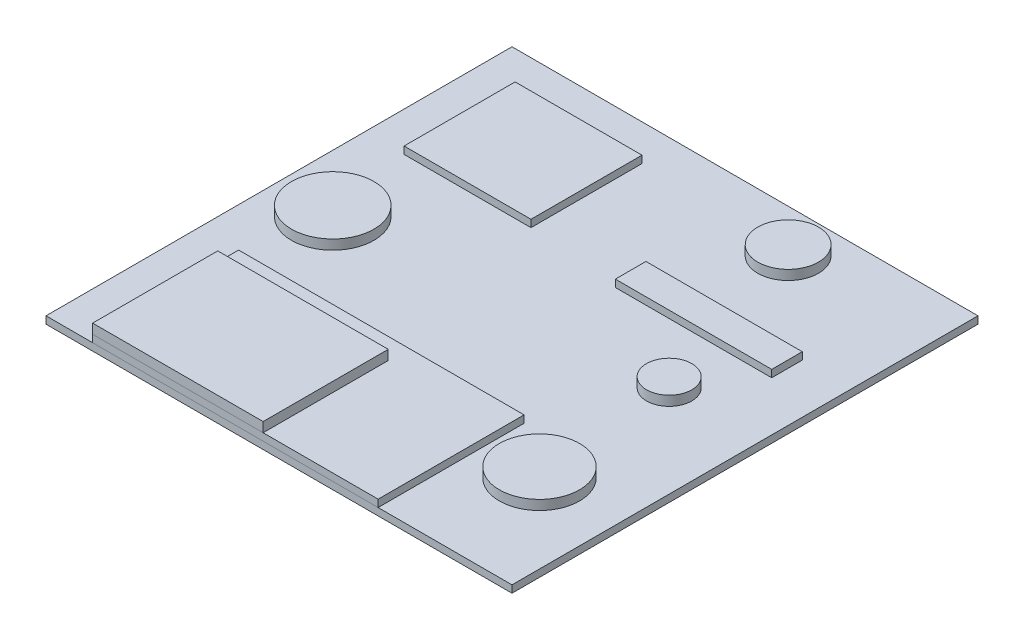
ISO-10303-21;
HEADER;
FILE_DESCRIPTION(('STEP AP214'),'2;1');
FILE_NAME('part.step','',(''),(''),'','','');
FILE_SCHEMA(('AUTOMOTIVE_DESIGN { 1 0 10303 214 1 1 1 1 }'));
ENDSEC;
DATA;
#1=APPLICATION_CONTEXT('core data for automotive mechanical design processes');
#2=APPLICATION_PROTOCOL_DEFINITION('international standard','automotive_design',2000,#1);
#3=PRODUCT_CONTEXT('',#1,'mechanical');
#4=PRODUCT('Part','Part','',(#3));
#5=PRODUCT_RELATED_PRODUCT_CATEGORY('part','',(#4));
#6=PRODUCT_DEFINITION_FORMATION('','',#4);
#7=PRODUCT_DEFINITION_CONTEXT('part definition',#1,'design');
#8=PRODUCT_DEFINITION('design','',#6,#7);
#9=PRODUCT_DEFINITION_SHAPE('','',#8);
#10=(LENGTH_UNIT() NAMED_UNIT(*) SI_UNIT(.MILLI.,.METRE.));
#11=(NAMED_UNIT(*) PLANE_ANGLE_UNIT() SI_UNIT($,.RADIAN.));
#12=(NAMED_UNIT(*) SI_UNIT($,.STERADIAN.) SOLID_ANGLE_UNIT());
#13=UNCERTAINTY_MEASURE_WITH_UNIT(LENGTH_MEASURE(1.E-05),#10,'distance_accuracy_value','');
#14=(GEOMETRIC_REPRESENTATION_CONTEXT(3) GLOBAL_UNCERTAINTY_ASSIGNED_CONTEXT((#13)) GLOBAL_UNIT_ASSIGNED_CONTEXT((#10,
#11,#12)) REPRESENTATION_CONTEXT('',''));
#15=CARTESIAN_POINT('',(0.,0.,0.));
#16=DIRECTION('',(0.,0.,1.));
#17=DIRECTION('',(1.,0.,0.));
#18=AXIS2_PLACEMENT_3D('',#15,#16,#17);
#19=CARTESIAN_POINT('',(403.079177233023,44.45,331.2066033514));
#20=DIRECTION('',(0.,-1.,0.));
#21=DIRECTION('',(0.,0.,-1.));
#22=AXIS2_PLACEMENT_3D('',#19,#20,#21);
#23=CYLINDRICAL_SURFACE('',#22,104.975218642877);
#24=CARTESIAN_POINT('',(403.079177233023,44.45,331.2066033514));
#25=DIRECTION('',(0.,1.,0.));
#26=DIRECTION('',(0.,0.,1.));
#27=AXIS2_PLACEMENT_3D('',#24,#25,#26);
#28=CIRCLE('',#27,104.975218642877);
#29=CARTESIAN_POINT('',(403.079177233023,44.45,436.181821994277));
#30=VERTEX_POINT('',#29);
#31=EDGE_CURVE('E11',#30,#30,#28,.T.);
#32=ORIENTED_EDGE('',*,*,#31,.F.);
#33=EDGE_LOOP('',(#32));
#34=FACE_BOUND('',#33,.T.);
#35=CARTESIAN_POINT('',(403.079177233023,19.05,331.2066033514));
#36=DIRECTION('',(0.,1.,0.));
#37=DIRECTION('',(0.,0.,1.));
#38=AXIS2_PLACEMENT_3D('',#35,#36,#37);
#39=CIRCLE('',#38,104.975218642877);
#40=CARTESIAN_POINT('',(403.079177233023,19.05,436.181821994277));
#41=VERTEX_POINT('',#40);
#42=EDGE_CURVE('E45',#41,#41,#39,.T.);
#43=ORIENTED_EDGE('',*,*,#42,.T.);
#44=EDGE_LOOP('',(#43));
#45=FACE_BOUND('',#44,.T.);
#46=ADVANCED_FACE('F42',(#34,#45),#23,.T.);
#47=CARTESIAN_POINT('',(403.079177233023,44.45,331.2066033514));
#48=DIRECTION('',(0.,1.,0.));
#49=DIRECTION('',(0.,0.,1.));
#50=AXIS2_PLACEMENT_3D('',#47,#48,#49);
#51=PLANE('',#50);
#52=ORIENTED_EDGE('',*,*,#31,.T.);
#53=EDGE_LOOP('',(#52));
#54=FACE_BOUND('',#53,.T.);
#55=ADVANCED_FACE('F57',(#54),#51,.T.);
#56=CARTESIAN_POINT('',(403.079177233023,19.05,331.2066033514));
#57=DIRECTION('',(0.,1.,0.));
#58=DIRECTION('',(0.,0.,1.));
#59=AXIS2_PLACEMENT_3D('',#56,#57,#58);
#60=PLANE('',#59);
#61=ORIENTED_EDGE('',*,*,#42,.F.);
#62=EDGE_LOOP('',(#61));
#63=FACE_BOUND('',#62,.T.);
#64=ADVANCED_FACE('F55',(#63),#60,.F.);
#65=CLOSED_SHELL('',(#46,#55,#64));
#66=MANIFOLD_SOLID_BREP('B2',#65);
#67=CARTESIAN_POINT('',(225.250128453748,44.45,-497.180382212056));
#68=DIRECTION('',(0.,-1.,0.));
#69=DIRECTION('',(0.,0.,-1.));
#70=AXIS2_PLACEMENT_3D('',#67,#68,#69);
#71=CYLINDRICAL_SURFACE('',#70,79.4308614038405);
#72=CARTESIAN_POINT('',(225.250128453748,44.45,-497.180382212056));
#73=DIRECTION('',(0.,1.,0.));
#74=DIRECTION('',(0.,0.,1.));
#75=AXIS2_PLACEMENT_3D('',#72,#73,#74);
#76=CIRCLE('',#75,79.4308614038405);
#77=CARTESIAN_POINT('',(225.250128453748,44.45,-417.749520808216));
#78=VERTEX_POINT('',#77);
#79=EDGE_CURVE('E41',#78,#78,#76,.T.);
#80=ORIENTED_EDGE('',*,*,#79,.F.);
#81=EDGE_LOOP('',(#80));
#82=FACE_BOUND('',#81,.T.);
#83=CARTESIAN_POINT('',(225.250128453748,19.05,-497.180382212056));
#84=DIRECTION('',(0.,1.,0.));
#85=DIRECTION('',(0.,0.,1.));
#86=AXIS2_PLACEMENT_3D('',#83,#84,#85);
#87=CIRCLE('',#86,79.4308614038405);
#88=CARTESIAN_POINT('',(225.250128453748,19.05,-417.749520808216));
#89=VERTEX_POINT('',#88);
#90=EDGE_CURVE('E96',#89,#89,#87,.T.);
#91=ORIENTED_EDGE('',*,*,#90,.T.);
#92=EDGE_LOOP('',(#91));
#93=FACE_BOUND('',#92,.T.);
#94=ADVANCED_FACE('F93',(#82,#93),#71,.T.);
#95=CARTESIAN_POINT('',(225.250128453748,44.45,-497.180382212056));
#96=DIRECTION('',(0.,1.,0.));
#97=DIRECTION('',(0.,0.,1.));
#98=AXIS2_PLACEMENT_3D('',#95,#96,#97);
#99=PLANE('',#98);
#100=ORIENTED_EDGE('',*,*,#79,.T.);
#101=EDGE_LOOP('',(#100));
#102=FACE_BOUND('',#101,.T.);
#103=ADVANCED_FACE('F108',(#102),#99,.T.);
#104=CARTESIAN_POINT('',(225.250128453748,19.05,-497.180382212056));
#105=DIRECTION('',(0.,1.,0.));
#106=DIRECTION('',(0.,0.,1.));
#107=AXIS2_PLACEMENT_3D('',#104,#105,#106);
#108=PLANE('',#107);
#109=ORIENTED_EDGE('',*,*,#90,.F.);
#110=EDGE_LOOP('',(#109));
#111=FACE_BOUND('',#110,.T.);
#112=ADVANCED_FACE('F106',(#111),#108,.F.);
#113=CLOSED_SHELL('',(#94,#103,#112));
#114=MANIFOLD_SOLID_BREP('B6',#113);
#115=CARTESIAN_POINT('',(368.995276216995,44.45,-42.2343990850776));
#116=DIRECTION('',(0.,-1.,0.));
#117=DIRECTION('',(0.,0.,-1.));
#118=AXIS2_PLACEMENT_3D('',#115,#116,#117);
#119=CYLINDRICAL_SURFACE('',#118,59.2763495930917);
#120=CARTESIAN_POINT('',(368.995276216995,44.45,-42.2343990850776));
#121=DIRECTION('',(0.,1.,0.));
#122=DIRECTION('',(0.,0.,1.));
#123=AXIS2_PLACEMENT_3D('',#120,#121,#122);
#124=CIRCLE('',#123,59.2763495930917);
#125=CARTESIAN_POINT('',(368.995276216995,44.45,17.0419505080142));
#126=VERTEX_POINT('',#125);
#127=EDGE_CURVE('E92',#126,#126,#124,.T.);
#128=ORIENTED_EDGE('',*,*,#127,.F.);
#129=EDGE_LOOP('',(#128));
#130=FACE_BOUND('',#129,.T.);
#131=CARTESIAN_POINT('',(368.995276216995,19.05,-42.2343990850776));
#132=DIRECTION('',(0.,1.,0.));
#133=DIRECTION('',(0.,0.,1.));
#134=AXIS2_PLACEMENT_3D('',#131,#132,#133);
#135=CIRCLE('',#134,59.2763495930917);
#136=CARTESIAN_POINT('',(368.995276216995,19.05,17.0419505080142));
#137=VERTEX_POINT('',#136);
#138=EDGE_CURVE('E147',#137,#137,#135,.T.);
#139=ORIENTED_EDGE('',*,*,#138,.T.);
#140=EDGE_LOOP('',(#139));
#141=FACE_BOUND('',#140,.T.);
#142=ADVANCED_FACE('F144',(#130,#141),#119,.T.);
#143=CARTESIAN_POINT('',(368.995276216995,44.45,-42.2343990850776));
#144=DIRECTION('',(0.,1.,0.));
#145=DIRECTION('',(0.,0.,1.));
#146=AXIS2_PLACEMENT_3D('',#143,#144,#145);
#147=PLANE('',#146);
#148=ORIENTED_EDGE('',*,*,#127,.T.);
#149=EDGE_LOOP('',(#148));
#150=FACE_BOUND('',#149,.T.);
#151=ADVANCED_FACE('F159',(#150),#147,.T.);
#152=CARTESIAN_POINT('',(368.995276216995,19.05,-42.2343990850776));
#153=DIRECTION('',(0.,1.,0.));
#154=DIRECTION('',(0.,0.,1.));
#155=AXIS2_PLACEMENT_3D('',#152,#153,#154);
#156=PLANE('',#155);
#157=ORIENTED_EDGE('',*,*,#138,.F.);
#158=EDGE_LOOP('',(#157));
#159=FACE_BOUND('',#158,.T.);
#160=ADVANCED_FACE('F157',(#159),#156,.F.);
#161=CLOSED_SHELL('',(#142,#151,#160));
#162=MANIFOLD_SOLID_BREP('B36',#161);
#163=CARTESIAN_POINT('',(-459.391709346461,44.45,9.63240680887765));
#164=DIRECTION('',(0.,-1.,0.));
#165=DIRECTION('',(0.,0.,-1.));
#166=AXIS2_PLACEMENT_3D('',#163,#164,#165);
#167=CYLINDRICAL_SURFACE('',#166,107.935461676881);
#168=CARTESIAN_POINT('',(-459.391709346461,44.45,9.63240680887765));
#169=DIRECTION('',(0.,1.,0.));
#170=DIRECTION('',(0.,0.,1.));
#171=AXIS2_PLACEMENT_3D('',#168,#169,#170);
#172=CIRCLE('',#171,107.935461676881);
#173=CARTESIAN_POINT('',(-459.391709346461,44.45,117.567868485758));
#174=VERTEX_POINT('',#173);
#175=EDGE_CURVE('E143',#174,#174,#172,.T.);
#176=ORIENTED_EDGE('',*,*,#175,.F.);
#177=EDGE_LOOP('',(#176));
#178=FACE_BOUND('',#177,.T.);
#179=CARTESIAN_POINT('',(-459.391709346461,19.05,9.63240680887765));
#180=DIRECTION('',(0.,1.,0.));
#181=DIRECTION('',(0.,0.,1.));
#182=AXIS2_PLACEMENT_3D('',#179,#180,#181);
#183=CIRCLE('',#182,107.935461676881);
#184=CARTESIAN_POINT('',(-459.391709346461,19.05,117.567868485758));
#185=VERTEX_POINT('',#184);
#186=EDGE_CURVE('E200',#185,#185,#183,.T.);
#187=ORIENTED_EDGE('',*,*,#186,.T.);
#188=EDGE_LOOP('',(#187));
#189=FACE_BOUND('',#188,.T.);
#190=ADVANCED_FACE('F197',(#178,#189),#167,.T.);
#191=CARTESIAN_POINT('',(-459.391709346461,44.45,9.63240680887765));
#192=DIRECTION('',(0.,1.,0.));
#193=DIRECTION('',(0.,0.,1.));
#194=AXIS2_PLACEMENT_3D('',#191,#192,#193);
#195=PLANE('',#194);
#196=ORIENTED_EDGE('',*,*,#175,.T.);
#197=EDGE_LOOP('',(#196));
#198=FACE_BOUND('',#197,.T.);
#199=ADVANCED_FACE('F212',(#198),#195,.T.);
#200=CARTESIAN_POINT('',(-459.391709346461,19.05,9.63240680887765));
#201=DIRECTION('',(0.,1.,0.));
#202=DIRECTION('',(0.,0.,1.));
#203=AXIS2_PLACEMENT_3D('',#200,#201,#202);
#204=PLANE('',#203);
#205=ORIENTED_EDGE('',*,*,#186,.F.);
#206=EDGE_LOOP('',(#205));
#207=FACE_BOUND('',#206,.T.);
#208=ADVANCED_FACE('F210',(#207),#204,.F.);
#209=CLOSED_SHELL('',(#190,#199,#208));
#210=MANIFOLD_SOLID_BREP('B87',#209);
#211=CARTESIAN_POINT('',(-487.547975403179,63.5,282.303614937099));
#212=DIRECTION('',(1.,0.,0.));
#213=DIRECTION('',(0.,0.,-1.));
#214=AXIS2_PLACEMENT_3D('',#211,#212,#213);
#215=PLANE('',#214);
#216=DIRECTION('',(0.,0.,1.));
#217=VECTOR('',#216,1.);
#218=CARTESIAN_POINT('',(-487.547975403179,38.1,282.303614937099));
#219=LINE('',#218,#217);
#220=CARTESIAN_POINT('',(-487.547975403179,38.1,282.303614937099));
#221=VERTEX_POINT('',#220);
#222=CARTESIAN_POINT('',(-487.547975403179,38.1,609.6));
#223=VERTEX_POINT('',#222);
#224=EDGE_CURVE('E312',#221,#223,#219,.T.);
#225=ORIENTED_EDGE('',*,*,#224,.T.);
#226=DIRECTION('',(0.,-1.,0.));
#227=VECTOR('',#226,1.);
#228=CARTESIAN_POINT('',(-487.547975403179,63.5,609.6));
#229=LINE('',#228,#227);
#230=CARTESIAN_POINT('',(-487.547975403179,63.5,609.6));
#231=VERTEX_POINT('',#230);
#232=EDGE_CURVE('E195',#231,#223,#229,.T.);
#233=ORIENTED_EDGE('',*,*,#232,.F.);
#234=DIRECTION('',(0.,0.,1.));
#235=VECTOR('',#234,1.);
#236=CARTESIAN_POINT('',(-487.547975403179,63.5,282.303614937099));
#237=LINE('',#236,#235);
#238=CARTESIAN_POINT('',(-487.547975403179,63.5,282.303614937099));
#239=VERTEX_POINT('',#238);
#240=EDGE_CURVE('E300',#239,#231,#237,.T.);
#241=ORIENTED_EDGE('',*,*,#240,.F.);
#242=DIRECTION('',(0.,-1.,0.));
#243=VECTOR('',#242,1.);
#244=CARTESIAN_POINT('',(-487.547975403179,63.5,282.303614937099));
#245=LINE('',#244,#243);
#246=EDGE_CURVE('E308',#239,#221,#245,.T.);
#247=ORIENTED_EDGE('',*,*,#246,.T.);
#248=EDGE_LOOP('',(#225,#233,#241,#247));
#249=FACE_BOUND('',#248,.T.);
#250=ADVANCED_FACE('F249',(#249),#215,.F.);
#251=CARTESIAN_POINT('',(-487.547975403179,63.5,609.6));
#252=DIRECTION('',(0.,0.,-1.));
#253=DIRECTION('',(-1.,0.,0.));
#254=AXIS2_PLACEMENT_3D('',#251,#252,#253);
#255=PLANE('',#254);
#256=DIRECTION('',(1.,0.,0.));
#257=VECTOR('',#256,1.);
#258=CARTESIAN_POINT('',(-487.547975403179,38.1,609.6));
#259=LINE('',#258,#257);
#260=CARTESIAN_POINT('',(-41.4934447151643,38.1,609.6));
#261=VERTEX_POINT('',#260);
#262=EDGE_CURVE('E304',#223,#261,#259,.T.);
#263=ORIENTED_EDGE('',*,*,#262,.T.);
#264=DIRECTION('',(0.,-1.,0.));
#265=VECTOR('',#264,1.);
#266=CARTESIAN_POINT('',(-41.4934447151643,63.5,609.6));
#267=LINE('',#266,#265);
#268=CARTESIAN_POINT('',(-41.4934447151643,63.5,609.6));
#269=VERTEX_POINT('',#268);
#270=EDGE_CURVE('E257',#269,#261,#267,.T.);
#271=ORIENTED_EDGE('',*,*,#270,.F.);
#272=DIRECTION('',(1.,0.,0.));
#273=VECTOR('',#272,1.);
#274=CARTESIAN_POINT('',(-487.547975403179,63.5,609.6));
#275=LINE('',#274,#273);
#276=EDGE_CURVE('E295',#231,#269,#275,.T.);
#277=ORIENTED_EDGE('',*,*,#276,.F.);
#278=ORIENTED_EDGE('',*,*,#232,.T.);
#279=EDGE_LOOP('',(#263,#271,#277,#278));
#280=FACE_BOUND('',#279,.T.);
#281=ADVANCED_FACE('F303',(#280),#255,.F.);
#282=CARTESIAN_POINT('',(-41.4934447151643,63.5,282.303614937099));
#283=DIRECTION('',(-1.,0.,0.));
#284=DIRECTION('',(0.,0.,1.));
#285=AXIS2_PLACEMENT_3D('',#282,#283,#284);
#286=PLANE('',#285);
#287=DIRECTION('',(0.,0.,-1.));
#288=VECTOR('',#287,1.);
#289=CARTESIAN_POINT('',(-41.4934447151643,38.1,282.303614937099));
#290=LINE('',#289,#288);
#291=CARTESIAN_POINT('',(-41.4934447151643,38.1,282.303614937099));
#292=VERTEX_POINT('',#291);
#293=EDGE_CURVE('E282',#261,#292,#290,.T.);
#294=ORIENTED_EDGE('',*,*,#293,.T.);
#295=DIRECTION('',(0.,-1.,0.));
#296=VECTOR('',#295,1.);
#297=CARTESIAN_POINT('',(-41.4934447151643,63.5,282.303614937099));
#298=LINE('',#297,#296);
#299=CARTESIAN_POINT('',(-41.4934447151643,63.5,282.303614937099));
#300=VERTEX_POINT('',#299);
#301=EDGE_CURVE('E305',#300,#292,#298,.T.);
#302=ORIENTED_EDGE('',*,*,#301,.F.);
#303=DIRECTION('',(0.,0.,-1.));
#304=VECTOR('',#303,1.);
#305=CARTESIAN_POINT('',(-41.4934447151643,63.5,282.303614937099));
#306=LINE('',#305,#304);
#307=EDGE_CURVE('E298',#269,#300,#306,.T.);
#308=ORIENTED_EDGE('',*,*,#307,.F.);
#309=ORIENTED_EDGE('',*,*,#270,.T.);
#310=EDGE_LOOP('',(#294,#302,#308,#309));
#311=FACE_BOUND('',#310,.T.);
#312=ADVANCED_FACE('F306',(#311),#286,.F.);
#313=CARTESIAN_POINT('',(-487.547975403179,63.5,282.303614937099));
#314=DIRECTION('',(0.,0.,1.));
#315=DIRECTION('',(1.,0.,0.));
#316=AXIS2_PLACEMENT_3D('',#313,#314,#315);
#317=PLANE('',#316);
#318=DIRECTION('',(-1.,0.,0.));
#319=VECTOR('',#318,1.);
#320=CARTESIAN_POINT('',(-487.547975403179,38.1,282.303614937099));
#321=LINE('',#320,#319);
#322=EDGE_CURVE('E288',#292,#221,#321,.T.);
#323=ORIENTED_EDGE('',*,*,#322,.T.);
#324=ORIENTED_EDGE('',*,*,#246,.F.);
#325=DIRECTION('',(-1.,0.,0.));
#326=VECTOR('',#325,1.);
#327=CARTESIAN_POINT('',(-487.547975403179,63.5,282.303614937099));
#328=LINE('',#327,#326);
#329=EDGE_CURVE('E265',#300,#239,#328,.T.);
#330=ORIENTED_EDGE('',*,*,#329,.F.);
#331=ORIENTED_EDGE('',*,*,#301,.T.);
#332=EDGE_LOOP('',(#323,#324,#330,#331));
#333=FACE_BOUND('',#332,.T.);
#334=ADVANCED_FACE('F319',(#333),#317,.F.);
#335=CARTESIAN_POINT('',(-487.547975403179,63.5,609.6));
#336=DIRECTION('',(0.,1.,0.));
#337=DIRECTION('',(0.,0.,1.));
#338=AXIS2_PLACEMENT_3D('',#335,#336,#337);
#339=PLANE('',#338);
#340=ORIENTED_EDGE('',*,*,#240,.T.);
#341=ORIENTED_EDGE('',*,*,#276,.T.);
#342=ORIENTED_EDGE('',*,*,#307,.T.);
#343=ORIENTED_EDGE('',*,*,#329,.T.);
#344=EDGE_LOOP('',(#340,#341,#342,#343));
#345=FACE_BOUND('',#344,.T.);
#346=ADVANCED_FACE('F296',(#345),#339,.T.);
#347=CARTESIAN_POINT('',(-487.547975403179,38.1,609.6));
#348=DIRECTION('',(0.,1.,0.));
#349=DIRECTION('',(0.,0.,1.));
#350=AXIS2_PLACEMENT_3D('',#347,#348,#349);
#351=PLANE('',#350);
#352=ORIENTED_EDGE('',*,*,#224,.F.);
#353=ORIENTED_EDGE('',*,*,#322,.F.);
#354=ORIENTED_EDGE('',*,*,#293,.F.);
#355=ORIENTED_EDGE('',*,*,#262,.F.);
#356=EDGE_LOOP('',(#352,#353,#354,#355));
#357=FACE_BOUND('',#356,.T.);
#358=ADVANCED_FACE('F322',(#357),#351,.F.);
#359=CLOSED_SHELL('',(#250,#281,#312,#334,#346,#358));
#360=MANIFOLD_SOLID_BREP('B138',#359);
#361=CARTESIAN_POINT('',(259.334029469776,38.1,227.67843800242));
#362=DIRECTION('',(-1.,0.,0.));
#363=DIRECTION('',(0.,0.,1.));
#364=AXIS2_PLACEMENT_3D('',#361,#362,#363);
#365=PLANE('',#364);
#366=DIRECTION('',(0.,0.,-1.));
#367=VECTOR('',#366,1.);
#368=CARTESIAN_POINT('',(259.334029469776,19.05,227.67843800242));
#369=LINE('',#368,#367);
#370=CARTESIAN_POINT('',(259.334029469776,19.05,609.6));
#371=VERTEX_POINT('',#370);
#372=CARTESIAN_POINT('',(259.334029469776,19.05,227.67843800242));
#373=VERTEX_POINT('',#372);
#374=EDGE_CURVE('E447',#371,#373,#369,.T.);
#375=ORIENTED_EDGE('',*,*,#374,.T.);
#376=DIRECTION('',(0.,-1.,0.));
#377=VECTOR('',#376,1.);
#378=CARTESIAN_POINT('',(259.334029469776,38.1,227.67843800242));
#379=LINE('',#378,#377);
#380=CARTESIAN_POINT('',(259.334029469776,38.1,227.67843800242));
#381=VERTEX_POINT('',#380);
#382=EDGE_CURVE('E247',#381,#373,#379,.T.);
#383=ORIENTED_EDGE('',*,*,#382,.F.);
#384=DIRECTION('',(0.,0.,-1.));
#385=VECTOR('',#384,1.);
#386=CARTESIAN_POINT('',(259.334029469776,38.1,227.67843800242));
#387=LINE('',#386,#385);
#388=CARTESIAN_POINT('',(259.334029469776,38.1,609.6));
#389=VERTEX_POINT('',#388);
#390=EDGE_CURVE('E435',#389,#381,#387,.T.);
#391=ORIENTED_EDGE('',*,*,#390,.F.);
#392=DIRECTION('',(0.,-1.,0.));
#393=VECTOR('',#392,1.);
#394=CARTESIAN_POINT('',(259.334029469776,38.1,609.6));
#395=LINE('',#394,#393);
#396=EDGE_CURVE('E443',#389,#371,#395,.T.);
#397=ORIENTED_EDGE('',*,*,#396,.T.);
#398=EDGE_LOOP('',(#375,#383,#391,#397));
#399=FACE_BOUND('',#398,.T.);
#400=ADVANCED_FACE('F384',(#399),#365,.F.);
#401=CARTESIAN_POINT('',(-487.547975403179,38.1,227.67843800242));
#402=DIRECTION('',(0.,0.,1.));
#403=DIRECTION('',(1.,0.,0.));
#404=AXIS2_PLACEMENT_3D('',#401,#402,#403);
#405=PLANE('',#404);
#406=DIRECTION('',(-1.,0.,0.));
#407=VECTOR('',#406,1.);
#408=CARTESIAN_POINT('',(-487.547975403179,19.05,227.67843800242));
#409=LINE('',#408,#407);
#410=CARTESIAN_POINT('',(-487.547975403179,19.05,227.67843800242));
#411=VERTEX_POINT('',#410);
#412=EDGE_CURVE('E439',#373,#411,#409,.T.);
#413=ORIENTED_EDGE('',*,*,#412,.T.);
#414=DIRECTION('',(0.,-1.,0.));
#415=VECTOR('',#414,1.);
#416=CARTESIAN_POINT('',(-487.547975403179,38.1,227.67843800242));
#417=LINE('',#416,#415);
#418=CARTESIAN_POINT('',(-487.547975403179,38.1,227.67843800242));
#419=VERTEX_POINT('',#418);
#420=EDGE_CURVE('E392',#419,#411,#417,.T.);
#421=ORIENTED_EDGE('',*,*,#420,.F.);
#422=DIRECTION('',(-1.,0.,0.));
#423=VECTOR('',#422,1.);
#424=CARTESIAN_POINT('',(-487.547975403179,38.1,227.67843800242));
#425=LINE('',#424,#423);
#426=EDGE_CURVE('E430',#381,#419,#425,.T.);
#427=ORIENTED_EDGE('',*,*,#426,.F.);
#428=ORIENTED_EDGE('',*,*,#382,.T.);
#429=EDGE_LOOP('',(#413,#421,#427,#428));
#430=FACE_BOUND('',#429,.T.);
#431=ADVANCED_FACE('F438',(#430),#405,.F.);
#432=CARTESIAN_POINT('',(-487.547975403179,38.1,227.67843800242));
#433=DIRECTION('',(1.,0.,0.));
#434=DIRECTION('',(0.,0.,-1.));
#435=AXIS2_PLACEMENT_3D('',#432,#433,#434);
#436=PLANE('',#435);
#437=DIRECTION('',(0.,0.,1.));
#438=VECTOR('',#437,1.);
#439=CARTESIAN_POINT('',(-487.547975403179,19.05,227.67843800242));
#440=LINE('',#439,#438);
#441=CARTESIAN_POINT('',(-487.547975403179,19.05,609.6));
#442=VERTEX_POINT('',#441);
#443=EDGE_CURVE('E417',#411,#442,#440,.T.);
#444=ORIENTED_EDGE('',*,*,#443,.T.);
#445=DIRECTION('',(0.,-1.,0.));
#446=VECTOR('',#445,1.);
#447=CARTESIAN_POINT('',(-487.547975403179,38.1,609.6));
#448=LINE('',#447,#446);
#449=CARTESIAN_POINT('',(-487.547975403179,38.1,609.6));
#450=VERTEX_POINT('',#449);
#451=EDGE_CURVE('E440',#450,#442,#448,.T.);
#452=ORIENTED_EDGE('',*,*,#451,.F.);
#453=DIRECTION('',(0.,0.,1.));
#454=VECTOR('',#453,1.);
#455=CARTESIAN_POINT('',(-487.547975403179,38.1,227.67843800242));
#456=LINE('',#455,#454);
#457=EDGE_CURVE('E433',#419,#450,#456,.T.);
#458=ORIENTED_EDGE('',*,*,#457,.F.);
#459=ORIENTED_EDGE('',*,*,#420,.T.);
#460=EDGE_LOOP('',(#444,#452,#458,#459));
#461=FACE_BOUND('',#460,.T.);
#462=ADVANCED_FACE('F441',(#461),#436,.F.);
#463=CARTESIAN_POINT('',(-487.547975403179,38.1,609.6));
#464=DIRECTION('',(0.,0.,-1.));
#465=DIRECTION('',(-1.,0.,0.));
#466=AXIS2_PLACEMENT_3D('',#463,#464,#465);
#467=PLANE('',#466);
#468=DIRECTION('',(1.,0.,0.));
#469=VECTOR('',#468,1.);
#470=CARTESIAN_POINT('',(-487.547975403179,19.05,609.6));
#471=LINE('',#470,#469);
#472=EDGE_CURVE('E423',#442,#371,#471,.T.);
#473=ORIENTED_EDGE('',*,*,#472,.T.);
#474=ORIENTED_EDGE('',*,*,#396,.F.);
#475=DIRECTION('',(1.,0.,0.));
#476=VECTOR('',#475,1.);
#477=CARTESIAN_POINT('',(-487.547975403179,38.1,609.6));
#478=LINE('',#477,#476);
#479=EDGE_CURVE('E400',#450,#389,#478,.T.);
#480=ORIENTED_EDGE('',*,*,#479,.F.);
#481=ORIENTED_EDGE('',*,*,#451,.T.);
#482=EDGE_LOOP('',(#473,#474,#480,#481));
#483=FACE_BOUND('',#482,.T.);
#484=ADVANCED_FACE('F454',(#483),#467,.F.);
#485=CARTESIAN_POINT('',(259.334029469776,38.1,609.6));
#486=DIRECTION('',(0.,1.,0.));
#487=DIRECTION('',(0.,0.,1.));
#488=AXIS2_PLACEMENT_3D('',#485,#486,#487);
#489=PLANE('',#488);
#490=ORIENTED_EDGE('',*,*,#390,.T.);
#491=ORIENTED_EDGE('',*,*,#426,.T.);
#492=ORIENTED_EDGE('',*,*,#457,.T.);
#493=ORIENTED_EDGE('',*,*,#479,.T.);
#494=EDGE_LOOP('',(#490,#491,#492,#493));
#495=FACE_BOUND('',#494,.T.);
#496=ADVANCED_FACE('F431',(#495),#489,.T.);
#497=CARTESIAN_POINT('',(259.334029469776,19.05,609.6));
#498=DIRECTION('',(0.,1.,0.));
#499=DIRECTION('',(0.,0.,1.));
#500=AXIS2_PLACEMENT_3D('',#497,#498,#499);
#501=PLANE('',#500);
#502=ORIENTED_EDGE('',*,*,#374,.F.);
#503=ORIENTED_EDGE('',*,*,#472,.F.);
#504=ORIENTED_EDGE('',*,*,#443,.F.);
#505=ORIENTED_EDGE('',*,*,#412,.F.);
#506=EDGE_LOOP('',(#502,#503,#504,#505));
#507=FACE_BOUND('',#506,.T.);
#508=ADVANCED_FACE('F457',(#507),#501,.F.);
#509=CLOSED_SHELL('',(#400,#431,#462,#484,#496,#508));
#510=MANIFOLD_SOLID_BREP('B189',#509);
#511=CARTESIAN_POINT('',(480.138431704042,38.1,-279.339797457444));
#512=DIRECTION('',(-1.,0.,0.));
#513=DIRECTION('',(0.,0.,1.));
#514=AXIS2_PLACEMENT_3D('',#511,#512,#513);
#515=PLANE('',#514);
#516=DIRECTION('',(0.,0.,-1.));
#517=VECTOR('',#516,1.);
#518=CARTESIAN_POINT('',(480.138431704042,19.05,-279.339797457444));
#519=LINE('',#518,#517);
#520=CARTESIAN_POINT('',(480.138431704042,19.05,-199.316725506771));
#521=VERTEX_POINT('',#520);
#522=CARTESIAN_POINT('',(480.138431704042,19.05,-279.339797457444));
#523=VERTEX_POINT('',#522);
#524=EDGE_CURVE('E582',#521,#523,#519,.T.);
#525=ORIENTED_EDGE('',*,*,#524,.T.);
#526=DIRECTION('',(0.,-1.,0.));
#527=VECTOR('',#526,1.);
#528=CARTESIAN_POINT('',(480.138431704042,38.1,-279.339797457444));
#529=LINE('',#528,#527);
#530=CARTESIAN_POINT('',(480.138431704042,38.1,-279.339797457444));
#531=VERTEX_POINT('',#530);
#532=EDGE_CURVE('E382',#531,#523,#529,.T.);
#533=ORIENTED_EDGE('',*,*,#532,.F.);
#534=DIRECTION('',(0.,0.,-1.));
#535=VECTOR('',#534,1.);
#536=CARTESIAN_POINT('',(480.138431704042,38.1,-279.339797457444));
#537=LINE('',#536,#535);
#538=CARTESIAN_POINT('',(480.138431704042,38.1,-199.316725506771));
#539=VERTEX_POINT('',#538);
#540=EDGE_CURVE('E570',#539,#531,#537,.T.);
#541=ORIENTED_EDGE('',*,*,#540,.F.);
#542=DIRECTION('',(0.,-1.,0.));
#543=VECTOR('',#542,1.);
#544=CARTESIAN_POINT('',(480.138431704042,38.1,-199.316725506771));
#545=LINE('',#544,#543);
#546=EDGE_CURVE('E578',#539,#521,#545,.T.);
#547=ORIENTED_EDGE('',*,*,#546,.T.);
#548=EDGE_LOOP('',(#525,#533,#541,#547));
#549=FACE_BOUND('',#548,.T.);
#550=ADVANCED_FACE('F519',(#549),#515,.F.);
#551=CARTESIAN_POINT('',(71.13161951171,38.1,-279.339797457444));
#552=DIRECTION('',(0.,0.,1.));
#553=DIRECTION('',(1.,0.,0.));
#554=AXIS2_PLACEMENT_3D('',#551,#552,#553);
#555=PLANE('',#554);
#556=DIRECTION('',(-1.,0.,0.));
#557=VECTOR('',#556,1.);
#558=CARTESIAN_POINT('',(71.13161951171,19.05,-279.339797457444));
#559=LINE('',#558,#557);
#560=CARTESIAN_POINT('',(71.13161951171,19.05,-279.339797457444));
#561=VERTEX_POINT('',#560);
#562=EDGE_CURVE('E574',#523,#561,#559,.T.);
#563=ORIENTED_EDGE('',*,*,#562,.T.);
#564=DIRECTION('',(0.,-1.,0.));
#565=VECTOR('',#564,1.);
#566=CARTESIAN_POINT('',(71.13161951171,38.1,-279.339797457444));
#567=LINE('',#566,#565);
#568=CARTESIAN_POINT('',(71.13161951171,38.1,-279.339797457444));
#569=VERTEX_POINT('',#568);
#570=EDGE_CURVE('E527',#569,#561,#567,.T.);
#571=ORIENTED_EDGE('',*,*,#570,.F.);
#572=DIRECTION('',(-1.,0.,0.));
#573=VECTOR('',#572,1.);
#574=CARTESIAN_POINT('',(71.13161951171,38.1,-279.339797457444));
#575=LINE('',#574,#573);
#576=EDGE_CURVE('E565',#531,#569,#575,.T.);
#577=ORIENTED_EDGE('',*,*,#576,.F.);
#578=ORIENTED_EDGE('',*,*,#532,.T.);
#579=EDGE_LOOP('',(#563,#571,#577,#578));
#580=FACE_BOUND('',#579,.T.);
#581=ADVANCED_FACE('F573',(#580),#555,.F.);
#582=CARTESIAN_POINT('',(71.13161951171,38.1,-279.339797457444));
#583=DIRECTION('',(1.,0.,0.));
#584=DIRECTION('',(0.,0.,-1.));
#585=AXIS2_PLACEMENT_3D('',#582,#583,#584);
#586=PLANE('',#585);
#587=DIRECTION('',(0.,0.,1.));
#588=VECTOR('',#587,1.);
#589=CARTESIAN_POINT('',(71.13161951171,19.05,-279.339797457444));
#590=LINE('',#589,#588);
#591=CARTESIAN_POINT('',(71.13161951171,19.05,-199.316725506771));
#592=VERTEX_POINT('',#591);
#593=EDGE_CURVE('E552',#561,#592,#590,.T.);
#594=ORIENTED_EDGE('',*,*,#593,.T.);
#595=DIRECTION('',(0.,-1.,0.));
#596=VECTOR('',#595,1.);
#597=CARTESIAN_POINT('',(71.13161951171,38.1,-199.316725506771));
#598=LINE('',#597,#596);
#599=CARTESIAN_POINT('',(71.13161951171,38.1,-199.316725506771));
#600=VERTEX_POINT('',#599);
#601=EDGE_CURVE('E575',#600,#592,#598,.T.);
#602=ORIENTED_EDGE('',*,*,#601,.F.);
#603=DIRECTION('',(0.,0.,1.));
#604=VECTOR('',#603,1.);
#605=CARTESIAN_POINT('',(71.13161951171,38.1,-279.339797457444));
#606=LINE('',#605,#604);
#607=EDGE_CURVE('E568',#569,#600,#606,.T.);
#608=ORIENTED_EDGE('',*,*,#607,.F.);
#609=ORIENTED_EDGE('',*,*,#570,.T.);
#610=EDGE_LOOP('',(#594,#602,#608,#609));
#611=FACE_BOUND('',#610,.T.);
#612=ADVANCED_FACE('F576',(#611),#586,.F.);
#613=CARTESIAN_POINT('',(71.13161951171,38.1,-199.316725506771));
#614=DIRECTION('',(0.,0.,-1.));
#615=DIRECTION('',(-1.,0.,0.));
#616=AXIS2_PLACEMENT_3D('',#613,#614,#615);
#617=PLANE('',#616);
#618=DIRECTION('',(1.,0.,0.));
#619=VECTOR('',#618,1.);
#620=CARTESIAN_POINT('',(71.13161951171,19.05,-199.316725506771));
#621=LINE('',#620,#619);
#622=EDGE_CURVE('E558',#592,#521,#621,.T.);
#623=ORIENTED_EDGE('',*,*,#622,.T.);
#624=ORIENTED_EDGE('',*,*,#546,.F.);
#625=DIRECTION('',(1.,0.,0.));
#626=VECTOR('',#625,1.);
#627=CARTESIAN_POINT('',(71.13161951171,38.1,-199.316725506771));
#628=LINE('',#627,#626);
#629=EDGE_CURVE('E535',#600,#539,#628,.T.);
#630=ORIENTED_EDGE('',*,*,#629,.F.);
#631=ORIENTED_EDGE('',*,*,#601,.T.);
#632=EDGE_LOOP('',(#623,#624,#630,#631));
#633=FACE_BOUND('',#632,.T.);
#634=ADVANCED_FACE('F589',(#633),#617,.F.);
#635=CARTESIAN_POINT('',(480.138431704042,38.1,-199.316725506771));
#636=DIRECTION('',(0.,1.,0.));
#637=DIRECTION('',(0.,0.,1.));
#638=AXIS2_PLACEMENT_3D('',#635,#636,#637);
#639=PLANE('',#638);
#640=ORIENTED_EDGE('',*,*,#540,.T.);
#641=ORIENTED_EDGE('',*,*,#576,.T.);
#642=ORIENTED_EDGE('',*,*,#607,.T.);
#643=ORIENTED_EDGE('',*,*,#629,.T.);
#644=EDGE_LOOP('',(#640,#641,#642,#643));
#645=FACE_BOUND('',#644,.T.);
#646=ADVANCED_FACE('F566',(#645),#639,.T.);
#647=CARTESIAN_POINT('',(480.138431704042,19.05,-199.316725506771));
#648=DIRECTION('',(0.,1.,0.));
#649=DIRECTION('',(0.,0.,1.));
#650=AXIS2_PLACEMENT_3D('',#647,#648,#649);
#651=PLANE('',#650);
#652=ORIENTED_EDGE('',*,*,#524,.F.);
#653=ORIENTED_EDGE('',*,*,#622,.F.);
#654=ORIENTED_EDGE('',*,*,#593,.F.);
#655=ORIENTED_EDGE('',*,*,#562,.F.);
#656=EDGE_LOOP('',(#652,#653,#654,#655));
#657=FACE_BOUND('',#656,.T.);
#658=ADVANCED_FACE('F592',(#657),#651,.F.);
#659=CLOSED_SHELL('',(#550,#581,#612,#634,#646,#658));
#660=MANIFOLD_SOLID_BREP('B241',#659);
#661=CARTESIAN_POINT('',(-174.865231299621,38.1,-514.963287089984));
#662=DIRECTION('',(-1.,0.,0.));
#663=DIRECTION('',(0.,0.,1.));
#664=AXIS2_PLACEMENT_3D('',#661,#662,#663);
#665=PLANE('',#664);
#666=DIRECTION('',(0.,0.,-1.));
#667=VECTOR('',#666,1.);
#668=CARTESIAN_POINT('',(-174.865231299621,19.05,-514.963287089984));
#669=LINE('',#668,#667);
#670=CARTESIAN_POINT('',(-174.865231299621,19.05,-224.509174083835));
#671=VERTEX_POINT('',#670);
#672=CARTESIAN_POINT('',(-174.865231299621,19.05,-514.963287089984));
#673=VERTEX_POINT('',#672);
#674=EDGE_CURVE('E716',#671,#673,#669,.T.);
#675=ORIENTED_EDGE('',*,*,#674,.T.);
#676=DIRECTION('',(0.,-1.,0.));
#677=VECTOR('',#676,1.);
#678=CARTESIAN_POINT('',(-174.865231299621,38.1,-514.963287089984));
#679=LINE('',#678,#677);
#680=CARTESIAN_POINT('',(-174.865231299621,38.1,-514.963287089984));
#681=VERTEX_POINT('',#680);
#682=EDGE_CURVE('E517',#681,#673,#679,.T.);
#683=ORIENTED_EDGE('',*,*,#682,.F.);
#684=DIRECTION('',(0.,0.,-1.));
#685=VECTOR('',#684,1.);
#686=CARTESIAN_POINT('',(-174.865231299621,38.1,-514.963287089984));
#687=LINE('',#686,#685);
#688=CARTESIAN_POINT('',(-174.865231299621,38.1,-224.509174083835));
#689=VERTEX_POINT('',#688);
#690=EDGE_CURVE('E704',#689,#681,#687,.T.);
#691=ORIENTED_EDGE('',*,*,#690,.F.);
#692=DIRECTION('',(0.,-1.,0.));
#693=VECTOR('',#692,1.);
#694=CARTESIAN_POINT('',(-174.865231299621,38.1,-224.509174083835));
#695=LINE('',#694,#693);
#696=EDGE_CURVE('E712',#689,#671,#695,.T.);
#697=ORIENTED_EDGE('',*,*,#696,.T.);
#698=EDGE_LOOP('',(#675,#683,#691,#697));
#699=FACE_BOUND('',#698,.T.);
#700=ADVANCED_FACE('F653',(#699),#665,.F.);
#701=CARTESIAN_POINT('',(-506.812789020934,38.1,-514.963287089984));
#702=DIRECTION('',(0.,0.,1.));
#703=DIRECTION('',(1.,0.,0.));
#704=AXIS2_PLACEMENT_3D('',#701,#702,#703);
#705=PLANE('',#704);
#706=DIRECTION('',(-1.,0.,0.));
#707=VECTOR('',#706,1.);
#708=CARTESIAN_POINT('',(-506.812789020934,19.05,-514.963287089984));
#709=LINE('',#708,#707);
#710=CARTESIAN_POINT('',(-506.812789020934,19.05,-514.963287089984));
#711=VERTEX_POINT('',#710);
#712=EDGE_CURVE('E708',#673,#711,#709,.T.);
#713=ORIENTED_EDGE('',*,*,#712,.T.);
#714=DIRECTION('',(0.,-1.,0.));
#715=VECTOR('',#714,1.);
#716=CARTESIAN_POINT('',(-506.812789020934,38.1,-514.963287089984));
#717=LINE('',#716,#715);
#718=CARTESIAN_POINT('',(-506.812789020934,38.1,-514.963287089984));
#719=VERTEX_POINT('',#718);
#720=EDGE_CURVE('E661',#719,#711,#717,.T.);
#721=ORIENTED_EDGE('',*,*,#720,.F.);
#722=DIRECTION('',(-1.,0.,0.));
#723=VECTOR('',#722,1.);
#724=CARTESIAN_POINT('',(-506.812789020934,38.1,-514.963287089984));
#725=LINE('',#724,#723);
#726=EDGE_CURVE('E699',#681,#719,#725,.T.);
#727=ORIENTED_EDGE('',*,*,#726,.F.);
#728=ORIENTED_EDGE('',*,*,#682,.T.);
#729=EDGE_LOOP('',(#713,#721,#727,#728));
#730=FACE_BOUND('',#729,.T.);
#731=ADVANCED_FACE('F707',(#730),#705,.F.);
#732=CARTESIAN_POINT('',(-506.812789020934,38.1,-514.963287089984));
#733=DIRECTION('',(1.,0.,0.));
#734=DIRECTION('',(0.,0.,-1.));
#735=AXIS2_PLACEMENT_3D('',#732,#733,#734);
#736=PLANE('',#735);
#737=DIRECTION('',(0.,0.,1.));
#738=VECTOR('',#737,1.);
#739=CARTESIAN_POINT('',(-506.812789020934,19.05,-514.963287089984));
#740=LINE('',#739,#738);
#741=CARTESIAN_POINT('',(-506.812789020934,19.05,-224.509174083835));
#742=VERTEX_POINT('',#741);
#743=EDGE_CURVE('E686',#711,#742,#740,.T.);
#744=ORIENTED_EDGE('',*,*,#743,.T.);
#745=DIRECTION('',(0.,-1.,0.));
#746=VECTOR('',#745,1.);
#747=CARTESIAN_POINT('',(-506.812789020934,38.1,-224.509174083835));
#748=LINE('',#747,#746);
#749=CARTESIAN_POINT('',(-506.812789020934,38.1,-224.509174083835));
#750=VERTEX_POINT('',#749);
#751=EDGE_CURVE('E709',#750,#742,#748,.T.);
#752=ORIENTED_EDGE('',*,*,#751,.F.);
#753=DIRECTION('',(0.,0.,1.));
#754=VECTOR('',#753,1.);
#755=CARTESIAN_POINT('',(-506.812789020934,38.1,-514.963287089984));
#756=LINE('',#755,#754);
#757=EDGE_CURVE('E702',#719,#750,#756,.T.);
#758=ORIENTED_EDGE('',*,*,#757,.F.);
#759=ORIENTED_EDGE('',*,*,#720,.T.);
#760=EDGE_LOOP('',(#744,#752,#758,#759));
#761=FACE_BOUND('',#760,.T.);
#762=ADVANCED_FACE('F710',(#761),#736,.F.);
#763=CARTESIAN_POINT('',(-506.812789020934,38.1,-224.509174083835));
#764=DIRECTION('',(0.,0.,-1.));
#765=DIRECTION('',(-1.,0.,0.));
#766=AXIS2_PLACEMENT_3D('',#763,#764,#765);
#767=PLANE('',#766);
#768=DIRECTION('',(1.,0.,0.));
#769=VECTOR('',#768,1.);
#770=CARTESIAN_POINT('',(-506.812789020934,19.05,-224.509174083835));
#771=LINE('',#770,#769);
#772=EDGE_CURVE('E692',#742,#671,#771,.T.);
#773=ORIENTED_EDGE('',*,*,#772,.T.);
#774=ORIENTED_EDGE('',*,*,#696,.F.);
#775=DIRECTION('',(1.,0.,0.));
#776=VECTOR('',#775,1.);
#777=CARTESIAN_POINT('',(-506.812789020934,38.1,-224.509174083835));
#778=LINE('',#777,#776);
#779=EDGE_CURVE('E669',#750,#689,#778,.T.);
#780=ORIENTED_EDGE('',*,*,#779,.F.);
#781=ORIENTED_EDGE('',*,*,#751,.T.);
#782=EDGE_LOOP('',(#773,#774,#780,#781));
#783=FACE_BOUND('',#782,.T.);
#784=ADVANCED_FACE('F723',(#783),#767,.F.);
#785=CARTESIAN_POINT('',(-174.865231299621,38.1,-224.509174083835));
#786=DIRECTION('',(0.,1.,0.));
#787=DIRECTION('',(0.,0.,1.));
#788=AXIS2_PLACEMENT_3D('',#785,#786,#787);
#789=PLANE('',#788);
#790=ORIENTED_EDGE('',*,*,#690,.T.);
#791=ORIENTED_EDGE('',*,*,#726,.T.);
#792=ORIENTED_EDGE('',*,*,#757,.T.);
#793=ORIENTED_EDGE('',*,*,#779,.T.);
#794=EDGE_LOOP('',(#790,#791,#792,#793));
#795=FACE_BOUND('',#794,.T.);
#796=ADVANCED_FACE('F700',(#795),#789,.T.);
#797=CARTESIAN_POINT('',(-174.865231299621,19.05,-224.509174083835));
#798=DIRECTION('',(0.,1.,0.));
#799=DIRECTION('',(0.,0.,1.));
#800=AXIS2_PLACEMENT_3D('',#797,#798,#799);
#801=PLANE('',#800);
#802=ORIENTED_EDGE('',*,*,#674,.F.);
#803=ORIENTED_EDGE('',*,*,#772,.F.);
#804=ORIENTED_EDGE('',*,*,#743,.F.);
#805=ORIENTED_EDGE('',*,*,#712,.F.);
#806=EDGE_LOOP('',(#802,#803,#804,#805));
#807=FACE_BOUND('',#806,.T.);
#808=ADVANCED_FACE('F726',(#807),#801,.F.);
#809=CLOSED_SHELL('',(#700,#731,#762,#784,#796,#808));
#810=MANIFOLD_SOLID_BREP('B376',#809);
#811=CARTESIAN_POINT('',(609.6,19.05,609.6));
#812=DIRECTION('',(-1.,0.,0.));
#813=DIRECTION('',(0.,0.,1.));
#814=AXIS2_PLACEMENT_3D('',#811,#812,#813);
#815=PLANE('',#814);
#816=DIRECTION('',(0.,0.,-1.));
#817=VECTOR('',#816,1.);
#818=CARTESIAN_POINT('',(609.6,0.,609.6));
#819=LINE('',#818,#817);
#820=CARTESIAN_POINT('',(609.6,0.,609.6));
#821=VERTEX_POINT('',#820);
#822=CARTESIAN_POINT('',(609.6,0.,-609.6));
#823=VERTEX_POINT('',#822);
#824=EDGE_CURVE('E841',#821,#823,#819,.T.);
#825=ORIENTED_EDGE('',*,*,#824,.T.);
#826=DIRECTION('',(0.,-1.,0.));
#827=VECTOR('',#826,1.);
#828=CARTESIAN_POINT('',(609.6,19.05,-609.6));
#829=LINE('',#828,#827);
#830=CARTESIAN_POINT('',(609.6,19.05,-609.6));
#831=VERTEX_POINT('',#830);
#832=EDGE_CURVE('E651',#831,#823,#829,.T.);
#833=ORIENTED_EDGE('',*,*,#832,.F.);
#834=DIRECTION('',(0.,0.,-1.));
#835=VECTOR('',#834,1.);
#836=CARTESIAN_POINT('',(609.6,19.05,609.6));
#837=LINE('',#836,#835);
#838=CARTESIAN_POINT('',(609.6,19.05,609.6));
#839=VERTEX_POINT('',#838);
#840=EDGE_CURVE('E829',#839,#831,#837,.T.);
#841=ORIENTED_EDGE('',*,*,#840,.F.);
#842=DIRECTION('',(0.,-1.,0.));
#843=VECTOR('',#842,1.);
#844=CARTESIAN_POINT('',(609.6,19.05,609.6));
#845=LINE('',#844,#843);
#846=EDGE_CURVE('E837',#839,#821,#845,.T.);
#847=ORIENTED_EDGE('',*,*,#846,.T.);
#848=EDGE_LOOP('',(#825,#833,#841,#847));
#849=FACE_BOUND('',#848,.T.);
#850=ADVANCED_FACE('F778',(#849),#815,.F.);
#851=CARTESIAN_POINT('',(-609.6,19.05,-609.6));
#852=DIRECTION('',(0.,0.,1.));
#853=DIRECTION('',(1.,0.,0.));
#854=AXIS2_PLACEMENT_3D('',#851,#852,#853);
#855=PLANE('',#854);
#856=DIRECTION('',(-1.,0.,0.));
#857=VECTOR('',#856,1.);
#858=CARTESIAN_POINT('',(-609.6,0.,-609.6));
#859=LINE('',#858,#857);
#860=CARTESIAN_POINT('',(-609.6,0.,-609.6));
#861=VERTEX_POINT('',#860);
#862=EDGE_CURVE('E833',#823,#861,#859,.T.);
#863=ORIENTED_EDGE('',*,*,#862,.T.);
#864=DIRECTION('',(0.,-1.,0.));
#865=VECTOR('',#864,1.);
#866=CARTESIAN_POINT('',(-609.6,19.05,-609.6));
#867=LINE('',#866,#865);
#868=CARTESIAN_POINT('',(-609.6,19.05,-609.6));
#869=VERTEX_POINT('',#868);
#870=EDGE_CURVE('E786',#869,#861,#867,.T.);
#871=ORIENTED_EDGE('',*,*,#870,.F.);
#872=DIRECTION('',(-1.,0.,0.));
#873=VECTOR('',#872,1.);
#874=CARTESIAN_POINT('',(-609.6,19.05,-609.6));
#875=LINE('',#874,#873);
#876=EDGE_CURVE('E824',#831,#869,#875,.T.);
#877=ORIENTED_EDGE('',*,*,#876,.F.);
#878=ORIENTED_EDGE('',*,*,#832,.T.);
#879=EDGE_LOOP('',(#863,#871,#877,#878));
#880=FACE_BOUND('',#879,.T.);
#881=ADVANCED_FACE('F832',(#880),#855,.F.);
#882=CARTESIAN_POINT('',(-609.6,19.05,609.6));
#883=DIRECTION('',(1.,0.,0.));
#884=DIRECTION('',(0.,0.,-1.));
#885=AXIS2_PLACEMENT_3D('',#882,#883,#884);
#886=PLANE('',#885);
#887=DIRECTION('',(0.,0.,1.));
#888=VECTOR('',#887,1.);
#889=CARTESIAN_POINT('',(-609.6,0.,609.6));
#890=LINE('',#889,#888);
#891=CARTESIAN_POINT('',(-609.6,0.,609.6));
#892=VERTEX_POINT('',#891);
#893=EDGE_CURVE('E811',#861,#892,#890,.T.);
#894=ORIENTED_EDGE('',*,*,#893,.T.);
#895=DIRECTION('',(0.,-1.,0.));
#896=VECTOR('',#895,1.);
#897=CARTESIAN_POINT('',(-609.6,19.05,609.6));
#898=LINE('',#897,#896);
#899=CARTESIAN_POINT('',(-609.6,19.05,609.6));
#900=VERTEX_POINT('',#899);
#901=EDGE_CURVE('E834',#900,#892,#898,.T.);
#902=ORIENTED_EDGE('',*,*,#901,.F.);
#903=DIRECTION('',(0.,0.,1.));
#904=VECTOR('',#903,1.);
#905=CARTESIAN_POINT('',(-609.6,19.05,609.6));
#906=LINE('',#905,#904);
#907=EDGE_CURVE('E827',#869,#900,#906,.T.);
#908=ORIENTED_EDGE('',*,*,#907,.F.);
#909=ORIENTED_EDGE('',*,*,#870,.T.);
#910=EDGE_LOOP('',(#894,#902,#908,#909));
#911=FACE_BOUND('',#910,.T.);
#912=ADVANCED_FACE('F835',(#911),#886,.F.);
#913=CARTESIAN_POINT('',(-609.6,19.05,609.6));
#914=DIRECTION('',(0.,0.,-1.));
#915=DIRECTION('',(-1.,0.,0.));
#916=AXIS2_PLACEMENT_3D('',#913,#914,#915);
#917=PLANE('',#916);
#918=DIRECTION('',(1.,0.,0.));
#919=VECTOR('',#918,1.);
#920=CARTESIAN_POINT('',(-609.6,0.,609.6));
#921=LINE('',#920,#919);
#922=EDGE_CURVE('E817',#892,#821,#921,.T.);
#923=ORIENTED_EDGE('',*,*,#922,.T.);
#924=ORIENTED_EDGE('',*,*,#846,.F.);
#925=DIRECTION('',(1.,0.,0.));
#926=VECTOR('',#925,1.);
#927=CARTESIAN_POINT('',(-609.6,19.05,609.6));
#928=LINE('',#927,#926);
#929=EDGE_CURVE('E794',#900,#839,#928,.T.);
#930=ORIENTED_EDGE('',*,*,#929,.F.);
#931=ORIENTED_EDGE('',*,*,#901,.T.);
#932=EDGE_LOOP('',(#923,#924,#930,#931));
#933=FACE_BOUND('',#932,.T.);
#934=ADVANCED_FACE('F848',(#933),#917,.F.);
#935=CARTESIAN_POINT('',(609.599999999999,19.05,-609.6));
#936=DIRECTION('',(0.,-1.,0.));
#937=DIRECTION('',(0.,0.,-1.));
#938=AXIS2_PLACEMENT_3D('',#935,#936,#937);
#939=PLANE('',#938);
#940=ORIENTED_EDGE('',*,*,#840,.T.);
#941=ORIENTED_EDGE('',*,*,#876,.T.);
#942=ORIENTED_EDGE('',*,*,#907,.T.);
#943=ORIENTED_EDGE('',*,*,#929,.T.);
#944=EDGE_LOOP('',(#940,#941,#942,#943));
#945=FACE_BOUND('',#944,.T.);
#946=ADVANCED_FACE('F825',(#945),#939,.F.);
#947=CARTESIAN_POINT('',(609.599999999999,0.,-609.6));
#948=DIRECTION('',(0.,-1.,0.));
#949=DIRECTION('',(0.,0.,-1.));
#950=AXIS2_PLACEMENT_3D('',#947,#948,#949);
#951=PLANE('',#950);
#952=ORIENTED_EDGE('',*,*,#824,.F.);
#953=ORIENTED_EDGE('',*,*,#922,.F.);
#954=ORIENTED_EDGE('',*,*,#893,.F.);
#955=ORIENTED_EDGE('',*,*,#862,.F.);
#956=EDGE_LOOP('',(#952,#953,#954,#955));
#957=FACE_BOUND('',#956,.T.);
#958=ADVANCED_FACE('F851',(#957),#951,.T.);
#959=CLOSED_SHELL('',(#850,#881,#912,#934,#946,#958));
#960=MANIFOLD_SOLID_BREP('B511',#959);
#961=ADVANCED_BREP_SHAPE_REPRESENTATION('',(#18,#66,#114,#162,#210,#360,#510,#660,#810,#960),#14);
#962=SHAPE_DEFINITION_REPRESENTATION(#9,#961);
ENDSEC;
END-ISO-10303-21;
